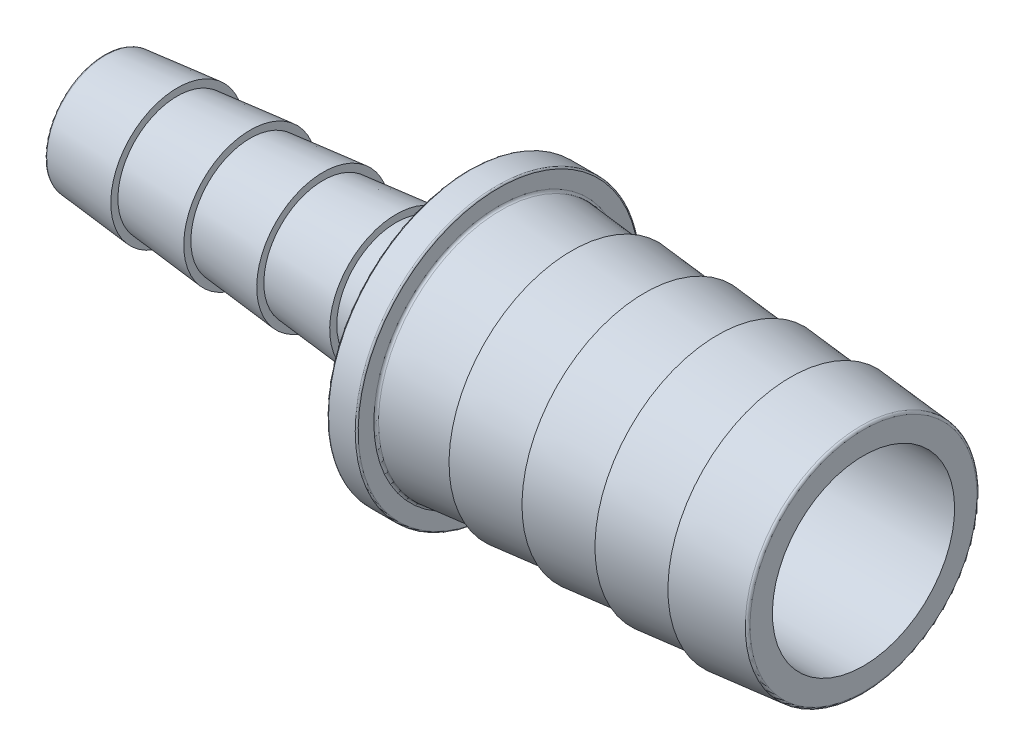
ISO-10303-21;
HEADER;
FILE_DESCRIPTION(('STEP AP214'),'2;1');
FILE_NAME('part.step','',(''),(''),'','','');
FILE_SCHEMA(('AUTOMOTIVE_DESIGN { 1 0 10303 214 1 1 1 1 }'));
ENDSEC;
DATA;
#1=APPLICATION_CONTEXT('core data for automotive mechanical design processes');
#2=APPLICATION_PROTOCOL_DEFINITION('international standard','automotive_design',2000,#1);
#3=PRODUCT_CONTEXT('',#1,'mechanical');
#4=PRODUCT('Part','Part','',(#3));
#5=PRODUCT_RELATED_PRODUCT_CATEGORY('part','',(#4));
#6=PRODUCT_DEFINITION_FORMATION('','',#4);
#7=PRODUCT_DEFINITION_CONTEXT('part definition',#1,'design');
#8=PRODUCT_DEFINITION('design','',#6,#7);
#9=PRODUCT_DEFINITION_SHAPE('','',#8);
#10=(LENGTH_UNIT() NAMED_UNIT(*) SI_UNIT(.MILLI.,.METRE.));
#11=(NAMED_UNIT(*) PLANE_ANGLE_UNIT() SI_UNIT($,.RADIAN.));
#12=(NAMED_UNIT(*) SI_UNIT($,.STERADIAN.) SOLID_ANGLE_UNIT());
#13=UNCERTAINTY_MEASURE_WITH_UNIT(LENGTH_MEASURE(1.E-05),#10,'distance_accuracy_value','');
#14=(GEOMETRIC_REPRESENTATION_CONTEXT(3) GLOBAL_UNCERTAINTY_ASSIGNED_CONTEXT((#13)) GLOBAL_UNIT_ASSIGNED_CONTEXT((#10,
#11,#12)) REPRESENTATION_CONTEXT('',''));
#15=CARTESIAN_POINT('',(0.,0.,0.));
#16=DIRECTION('',(0.,0.,1.));
#17=DIRECTION('',(1.,0.,0.));
#18=AXIS2_PLACEMENT_3D('',#15,#16,#17);
#19=CARTESIAN_POINT('',(-25.4,3.96875,0.));
#20=DIRECTION('',(1.,0.,0.));
#21=DIRECTION('',(0.,1.,0.));
#22=AXIS2_PLACEMENT_3D('',#19,#20,#21);
#23=PLANE('',#22);
#24=CARTESIAN_POINT('',(-25.4,0.,0.));
#25=DIRECTION('',(1.,0.,0.));
#26=DIRECTION('',(0.,1.,0.));
#27=AXIS2_PLACEMENT_3D('',#24,#25,#26);
#28=CIRCLE('',#27,3.83913486377598);
#29=CARTESIAN_POINT('',(-25.4,3.83913486377598,0.));
#30=VERTEX_POINT('',#29);
#31=EDGE_CURVE('E66',#30,#30,#28,.F.);
#32=ORIENTED_EDGE('',*,*,#31,.T.);
#33=EDGE_LOOP('',(#32));
#34=FACE_BOUND('',#33,.T.);
#35=CARTESIAN_POINT('',(-25.4,0.,0.));
#36=DIRECTION('',(-1.,0.,0.));
#37=DIRECTION('',(0.,-1.,0.));
#38=AXIS2_PLACEMENT_3D('',#35,#36,#37);
#39=CIRCLE('',#38,2.54);
#40=CARTESIAN_POINT('',(-25.4,-2.54,0.));
#41=VERTEX_POINT('',#40);
#42=EDGE_CURVE('E94',#41,#41,#39,.T.);
#43=ORIENTED_EDGE('',*,*,#42,.F.);
#44=EDGE_LOOP('',(#43));
#45=FACE_BOUND('',#44,.T.);
#46=ADVANCED_FACE('F38',(#34,#45),#23,.F.);
#47=CARTESIAN_POINT('',(-25.4,0.,0.));
#48=DIRECTION('',(-1.,0.,0.));
#49=DIRECTION('',(0.,-1.,0.));
#50=AXIS2_PLACEMENT_3D('',#47,#48,#49);
#51=CYLINDRICAL_SURFACE('',#50,2.54);
#52=CARTESIAN_POINT('',(-0.990600000000001,0.,0.));
#53=DIRECTION('',(-1.,0.,0.));
#54=DIRECTION('',(0.,-1.,0.));
#55=AXIS2_PLACEMENT_3D('',#52,#53,#54);
#56=CIRCLE('',#55,2.54);
#57=CARTESIAN_POINT('',(-0.990600000000001,-2.53999999999999,0.));
#58=VERTEX_POINT('',#57);
#59=EDGE_CURVE('E98',#58,#58,#56,.T.);
#60=ORIENTED_EDGE('',*,*,#59,.F.);
#61=EDGE_LOOP('',(#60));
#62=FACE_BOUND('',#61,.T.);
#63=ORIENTED_EDGE('',*,*,#42,.T.);
#64=EDGE_LOOP('',(#63));
#65=FACE_BOUND('',#64,.T.);
#66=ADVANCED_FACE('F218',(#62,#65),#51,.F.);
#67=CARTESIAN_POINT('',(-0.990600000000001,0.,0.));
#68=DIRECTION('',(1.,0.,0.));
#69=DIRECTION('',(0.,1.,0.));
#70=AXIS2_PLACEMENT_3D('',#67,#68,#69);
#71=CONICAL_SURFACE('',#70,2.54,1.06248570178407);
#72=CARTESIAN_POINT('',(0.990600000000005,0.,0.));
#73=DIRECTION('',(-1.,0.,0.));
#74=DIRECTION('',(0.,-1.,0.));
#75=AXIS2_PLACEMENT_3D('',#72,#73,#74);
#76=CIRCLE('',#75,6.09599999999999);
#77=CARTESIAN_POINT('',(0.990600000000006,-6.09599999999998,0.));
#78=VERTEX_POINT('',#77);
#79=EDGE_CURVE('E102',#78,#78,#76,.T.);
#80=ORIENTED_EDGE('',*,*,#79,.F.);
#81=EDGE_LOOP('',(#80));
#82=FACE_BOUND('',#81,.T.);
#83=ORIENTED_EDGE('',*,*,#59,.T.);
#84=EDGE_LOOP('',(#83));
#85=FACE_BOUND('',#84,.T.);
#86=ADVANCED_FACE('F224',(#82,#85),#71,.F.);
#87=CARTESIAN_POINT('',(-25.4,0.,0.));
#88=DIRECTION('',(-1.,0.,0.));
#89=DIRECTION('',(0.,-1.,0.));
#90=AXIS2_PLACEMENT_3D('',#87,#88,#89);
#91=CYLINDRICAL_SURFACE('',#90,6.09599999999999);
#92=CARTESIAN_POINT('',(25.4,0.,0.));
#93=DIRECTION('',(-1.,0.,0.));
#94=DIRECTION('',(0.,-1.,0.));
#95=AXIS2_PLACEMENT_3D('',#92,#93,#94);
#96=CIRCLE('',#95,6.09599999999999);
#97=CARTESIAN_POINT('',(25.4,-6.09599999999998,0.));
#98=VERTEX_POINT('',#97);
#99=EDGE_CURVE('E106',#98,#98,#96,.T.);
#100=ORIENTED_EDGE('',*,*,#99,.F.);
#101=EDGE_LOOP('',(#100));
#102=FACE_BOUND('',#101,.T.);
#103=ORIENTED_EDGE('',*,*,#79,.T.);
#104=EDGE_LOOP('',(#103));
#105=FACE_BOUND('',#104,.T.);
#106=ADVANCED_FACE('F293',(#102,#105),#91,.F.);
#107=CARTESIAN_POINT('',(25.4,7.747,0.));
#108=DIRECTION('',(-1.,0.,0.));
#109=DIRECTION('',(0.,-1.,0.));
#110=AXIS2_PLACEMENT_3D('',#107,#108,#109);
#111=PLANE('',#110);
#112=CARTESIAN_POINT('',(25.4,0.,0.));
#113=DIRECTION('',(-1.,0.,0.));
#114=DIRECTION('',(0.,-1.,0.));
#115=AXIS2_PLACEMENT_3D('',#112,#113,#114);
#116=CIRCLE('',#115,7.59663957144658);
#117=CARTESIAN_POINT('',(25.4,-7.59663957144657,0.));
#118=VERTEX_POINT('',#117);
#119=EDGE_CURVE('E10',#118,#118,#116,.F.);
#120=ORIENTED_EDGE('',*,*,#119,.T.);
#121=EDGE_LOOP('',(#120));
#122=FACE_BOUND('',#121,.T.);
#123=ORIENTED_EDGE('',*,*,#99,.T.);
#124=EDGE_LOOP('',(#123));
#125=FACE_BOUND('',#124,.T.);
#126=ADVANCED_FACE('F289',(#122,#125),#111,.F.);
#127=CARTESIAN_POINT('',(5.87248000000001,0.,0.));
#128=DIRECTION('',(-1.,0.,0.));
#129=DIRECTION('',(0.,-1.,0.));
#130=AXIS2_PLACEMENT_3D('',#127,#128,#129);
#131=CONICAL_SURFACE('',#130,7.74699999999999,0.0933800755950984);
#132=CARTESIAN_POINT('',(1.14030534545102,0.,0.));
#133=DIRECTION('',(-1.,0.,0.));
#134=DIRECTION('',(0.,-1.,0.));
#135=AXIS2_PLACEMENT_3D('',#132,#133,#134);
#136=CIRCLE('',#135,8.19017972831364);
#137=CARTESIAN_POINT('',(1.14030534545102,-8.19017972831363,0.));
#138=VERTEX_POINT('',#137);
#139=EDGE_CURVE('E51',#138,#138,#136,.F.);
#140=ORIENTED_EDGE('',*,*,#139,.T.);
#141=EDGE_LOOP('',(#140));
#142=FACE_BOUND('',#141,.T.);
#143=CARTESIAN_POINT('',(5.87247999999999,0.,0.));
#144=DIRECTION('',(-1.,0.,0.));
#145=DIRECTION('',(0.,-1.,0.));
#146=AXIS2_PLACEMENT_3D('',#143,#144,#145);
#147=CIRCLE('',#146,7.74699999999999);
#148=CARTESIAN_POINT('',(5.87248,-7.74699999999998,0.));
#149=VERTEX_POINT('',#148);
#150=EDGE_CURVE('E166',#149,#149,#147,.T.);
#151=ORIENTED_EDGE('',*,*,#150,.T.);
#152=EDGE_LOOP('',(#151));
#153=FACE_BOUND('',#152,.T.);
#154=ADVANCED_FACE('F261',(#142,#153),#131,.T.);
#155=CARTESIAN_POINT('',(0.990600000000004,9.4996,0.));
#156=DIRECTION('',(-1.,0.,0.));
#157=DIRECTION('',(0.,-1.,0.));
#158=AXIS2_PLACEMENT_3D('',#155,#156,#157);
#159=PLANE('',#158);
#160=CARTESIAN_POINT('',(0.990600000000006,0.,0.));
#161=DIRECTION('',(-1.,0.,0.));
#162=DIRECTION('',(0.,-1.,0.));
#163=AXIS2_PLACEMENT_3D('',#160,#161,#162);
#164=CIRCLE('',#163,8.35456042855341);
#165=CARTESIAN_POINT('',(0.990600000000008,-8.3545604285534,0.));
#166=VERTEX_POINT('',#165);
#167=EDGE_CURVE('E56',#166,#166,#164,.T.);
#168=ORIENTED_EDGE('',*,*,#167,.T.);
#169=EDGE_LOOP('',(#168));
#170=FACE_BOUND('',#169,.T.);
#171=CARTESIAN_POINT('',(0.990600000000006,0.,0.));
#172=DIRECTION('',(-1.,0.,0.));
#173=DIRECTION('',(0.,-1.,0.));
#174=AXIS2_PLACEMENT_3D('',#171,#172,#173);
#175=CIRCLE('',#174,9.40054);
#176=CARTESIAN_POINT('',(0.990600000000008,-9.40053999999999,0.));
#177=VERTEX_POINT('',#176);
#178=EDGE_CURVE('E82',#177,#177,#175,.F.);
#179=ORIENTED_EDGE('',*,*,#178,.T.);
#180=EDGE_LOOP('',(#179));
#181=FACE_BOUND('',#180,.T.);
#182=ADVANCED_FACE('F257',(#170,#181),#159,.F.);
#183=CARTESIAN_POINT('',(-25.4,0.,0.));
#184=DIRECTION('',(-1.,0.,0.));
#185=DIRECTION('',(0.,-1.,0.));
#186=AXIS2_PLACEMENT_3D('',#183,#184,#185);
#187=CYLINDRICAL_SURFACE('',#186,9.4996);
#188=CARTESIAN_POINT('',(0.891540000000007,0.,0.));
#189=DIRECTION('',(-1.,0.,0.));
#190=DIRECTION('',(0.,-1.,0.));
#191=AXIS2_PLACEMENT_3D('',#188,#189,#190);
#192=CIRCLE('',#191,9.4996);
#193=CARTESIAN_POINT('',(0.891540000000008,-9.49959999999999,0.));
#194=VERTEX_POINT('',#193);
#195=EDGE_CURVE('E86',#194,#194,#192,.T.);
#196=ORIENTED_EDGE('',*,*,#195,.T.);
#197=EDGE_LOOP('',(#196));
#198=FACE_BOUND('',#197,.T.);
#199=CARTESIAN_POINT('',(-0.891540000000007,0.,0.));
#200=DIRECTION('',(1.,0.,0.));
#201=DIRECTION('',(0.,1.,0.));
#202=AXIS2_PLACEMENT_3D('',#199,#200,#201);
#203=CIRCLE('',#202,9.4996);
#204=CARTESIAN_POINT('',(-0.891540000000008,9.4996,0.));
#205=VERTEX_POINT('',#204);
#206=EDGE_CURVE('E90',#205,#205,#203,.T.);
#207=ORIENTED_EDGE('',*,*,#206,.T.);
#208=EDGE_LOOP('',(#207));
#209=FACE_BOUND('',#208,.T.);
#210=ADVANCED_FACE('F260',(#198,#209),#187,.T.);
#211=CARTESIAN_POINT('',(-0.990600000000002,4.445,0.));
#212=DIRECTION('',(1.,0.,0.));
#213=DIRECTION('',(0.,1.,0.));
#214=AXIS2_PLACEMENT_3D('',#211,#212,#213);
#215=PLANE('',#214);
#216=CARTESIAN_POINT('',(-0.990600000000001,0.,0.));
#217=DIRECTION('',(1.,0.,0.));
#218=DIRECTION('',(0.,1.,0.));
#219=AXIS2_PLACEMENT_3D('',#216,#217,#218);
#220=CIRCLE('',#219,4.57461513622401);
#221=CARTESIAN_POINT('',(-0.990600000000002,4.57461513622402,0.));
#222=VERTEX_POINT('',#221);
#223=EDGE_CURVE('E70',#222,#222,#220,.T.);
#224=ORIENTED_EDGE('',*,*,#223,.T.);
#225=EDGE_LOOP('',(#224));
#226=FACE_BOUND('',#225,.T.);
#227=CARTESIAN_POINT('',(-0.990600000000001,0.,0.));
#228=DIRECTION('',(1.,0.,0.));
#229=DIRECTION('',(0.,1.,0.));
#230=AXIS2_PLACEMENT_3D('',#227,#228,#229);
#231=CIRCLE('',#230,9.40054);
#232=CARTESIAN_POINT('',(-0.990600000000002,9.40054,0.));
#233=VERTEX_POINT('',#232);
#234=EDGE_CURVE('E78',#233,#233,#231,.F.);
#235=ORIENTED_EDGE('',*,*,#234,.T.);
#236=EDGE_LOOP('',(#235));
#237=FACE_BOUND('',#236,.T.);
#238=ADVANCED_FACE('F269',(#226,#237),#215,.F.);
#239=CARTESIAN_POINT('',(-0.990600000000001,0.,0.));
#240=DIRECTION('',(1.,0.,0.));
#241=DIRECTION('',(0.,1.,0.));
#242=AXIS2_PLACEMENT_3D('',#239,#240,#241);
#243=CONICAL_SURFACE('',#242,4.44499999999999,0.0972469130544617);
#244=CARTESIAN_POINT('',(-1.11960273635716,0.,0.));
#245=DIRECTION('',(1.,0.,0.));
#246=DIRECTION('',(0.,1.,0.));
#247=AXIS2_PLACEMENT_3D('',#244,#245,#246);
#248=CIRCLE('',#247,4.43241518570917);
#249=CARTESIAN_POINT('',(-1.11960273635716,4.43241518570917,0.));
#250=VERTEX_POINT('',#249);
#251=EDGE_CURVE('E74',#250,#250,#248,.F.);
#252=ORIENTED_EDGE('',*,*,#251,.T.);
#253=EDGE_LOOP('',(#252));
#254=FACE_BOUND('',#253,.T.);
#255=CARTESIAN_POINT('',(-5.87248,0.,0.));
#256=DIRECTION('',(-1.,0.,0.));
#257=DIRECTION('',(0.,-1.,0.));
#258=AXIS2_PLACEMENT_3D('',#255,#256,#257);
#259=CIRCLE('',#258,3.96875);
#260=CARTESIAN_POINT('',(-5.87248,-3.96874999999999,0.));
#261=VERTEX_POINT('',#260);
#262=EDGE_CURVE('E110',#261,#261,#259,.T.);
#263=ORIENTED_EDGE('',*,*,#262,.F.);
#264=EDGE_LOOP('',(#263));
#265=FACE_BOUND('',#264,.T.);
#266=ADVANCED_FACE('F276',(#254,#265),#243,.T.);
#267=CARTESIAN_POINT('',(-20.51812,0.,0.));
#268=DIRECTION('',(1.,0.,0.));
#269=DIRECTION('',(0.,1.,0.));
#270=AXIS2_PLACEMENT_3D('',#267,#268,#269);
#271=CONICAL_SURFACE('',#270,4.445,0.0972469130544618);
#272=CARTESIAN_POINT('',(-25.2709972636428,0.,0.));
#273=DIRECTION('',(-1.,0.,0.));
#274=DIRECTION('',(0.,-1.,0.));
#275=AXIS2_PLACEMENT_3D('',#272,#273,#274);
#276=CIRCLE('',#275,3.98133481429083);
#277=CARTESIAN_POINT('',(-25.2709972636428,-3.98133481429083,0.));
#278=VERTEX_POINT('',#277);
#279=EDGE_CURVE('E62',#278,#278,#276,.F.);
#280=ORIENTED_EDGE('',*,*,#279,.T.);
#281=EDGE_LOOP('',(#280));
#282=FACE_BOUND('',#281,.T.);
#283=CARTESIAN_POINT('',(-20.51812,0.,0.));
#284=DIRECTION('',(-1.,0.,0.));
#285=DIRECTION('',(0.,-1.,0.));
#286=AXIS2_PLACEMENT_3D('',#283,#284,#285);
#287=CIRCLE('',#286,4.445);
#288=CARTESIAN_POINT('',(-20.51812,-4.445,0.));
#289=VERTEX_POINT('',#288);
#290=EDGE_CURVE('E114',#289,#289,#287,.T.);
#291=ORIENTED_EDGE('',*,*,#290,.T.);
#292=EDGE_LOOP('',(#291));
#293=FACE_BOUND('',#292,.T.);
#294=ADVANCED_FACE('F282',(#282,#293),#271,.T.);
#295=CARTESIAN_POINT('',(-20.51812,3.96875,0.));
#296=DIRECTION('',(-1.,0.,0.));
#297=DIRECTION('',(0.,-1.,0.));
#298=AXIS2_PLACEMENT_3D('',#295,#296,#297);
#299=PLANE('',#298);
#300=ORIENTED_EDGE('',*,*,#290,.F.);
#301=EDGE_LOOP('',(#300));
#302=FACE_BOUND('',#301,.T.);
#303=CARTESIAN_POINT('',(-20.51812,0.,0.));
#304=DIRECTION('',(-1.,0.,0.));
#305=DIRECTION('',(0.,-1.,0.));
#306=AXIS2_PLACEMENT_3D('',#303,#304,#305);
#307=CIRCLE('',#306,3.96875);
#308=CARTESIAN_POINT('',(-20.51812,-3.96875,0.));
#309=VERTEX_POINT('',#308);
#310=EDGE_CURVE('E122',#309,#309,#307,.T.);
#311=ORIENTED_EDGE('',*,*,#310,.T.);
#312=EDGE_LOOP('',(#311));
#313=FACE_BOUND('',#312,.T.);
#314=ADVANCED_FACE('F372',(#302,#313),#299,.F.);
#315=CARTESIAN_POINT('',(-15.63624,0.,0.));
#316=DIRECTION('',(1.,0.,0.));
#317=DIRECTION('',(0.,1.,0.));
#318=AXIS2_PLACEMENT_3D('',#315,#316,#317);
#319=CONICAL_SURFACE('',#318,4.445,0.0972469130544618);
#320=ORIENTED_EDGE('',*,*,#310,.F.);
#321=EDGE_LOOP('',(#320));
#322=FACE_BOUND('',#321,.T.);
#323=CARTESIAN_POINT('',(-15.63624,0.,0.));
#324=DIRECTION('',(-1.,0.,0.));
#325=DIRECTION('',(0.,-1.,0.));
#326=AXIS2_PLACEMENT_3D('',#323,#324,#325);
#327=CIRCLE('',#326,4.445);
#328=CARTESIAN_POINT('',(-15.63624,-4.445,0.));
#329=VERTEX_POINT('',#328);
#330=EDGE_CURVE('E118',#329,#329,#327,.T.);
#331=ORIENTED_EDGE('',*,*,#330,.T.);
#332=EDGE_LOOP('',(#331));
#333=FACE_BOUND('',#332,.T.);
#334=ADVANCED_FACE('F490',(#322,#333),#319,.T.);
#335=CARTESIAN_POINT('',(-15.63624,3.96875,0.));
#336=DIRECTION('',(-1.,0.,0.));
#337=DIRECTION('',(0.,-1.,0.));
#338=AXIS2_PLACEMENT_3D('',#335,#336,#337);
#339=PLANE('',#338);
#340=ORIENTED_EDGE('',*,*,#330,.F.);
#341=EDGE_LOOP('',(#340));
#342=FACE_BOUND('',#341,.T.);
#343=CARTESIAN_POINT('',(-15.63624,0.,0.));
#344=DIRECTION('',(-1.,0.,0.));
#345=DIRECTION('',(0.,-1.,0.));
#346=AXIS2_PLACEMENT_3D('',#343,#344,#345);
#347=CIRCLE('',#346,3.96875);
#348=CARTESIAN_POINT('',(-15.63624,-3.96875,0.));
#349=VERTEX_POINT('',#348);
#350=EDGE_CURVE('E130',#349,#349,#347,.T.);
#351=ORIENTED_EDGE('',*,*,#350,.T.);
#352=EDGE_LOOP('',(#351));
#353=FACE_BOUND('',#352,.T.);
#354=ADVANCED_FACE('F480',(#342,#353),#339,.F.);
#355=CARTESIAN_POINT('',(-10.75436,0.,0.));
#356=DIRECTION('',(1.,0.,0.));
#357=DIRECTION('',(0.,1.,0.));
#358=AXIS2_PLACEMENT_3D('',#355,#356,#357);
#359=CONICAL_SURFACE('',#358,4.445,0.0972469130544618);
#360=ORIENTED_EDGE('',*,*,#350,.F.);
#361=EDGE_LOOP('',(#360));
#362=FACE_BOUND('',#361,.T.);
#363=CARTESIAN_POINT('',(-10.75436,0.,0.));
#364=DIRECTION('',(-1.,0.,0.));
#365=DIRECTION('',(0.,-1.,0.));
#366=AXIS2_PLACEMENT_3D('',#363,#364,#365);
#367=CIRCLE('',#366,4.445);
#368=CARTESIAN_POINT('',(-10.75436,-4.445,0.));
#369=VERTEX_POINT('',#368);
#370=EDGE_CURVE('E126',#369,#369,#367,.T.);
#371=ORIENTED_EDGE('',*,*,#370,.T.);
#372=EDGE_LOOP('',(#371));
#373=FACE_BOUND('',#372,.T.);
#374=ADVANCED_FACE('F470',(#362,#373),#359,.T.);
#375=CARTESIAN_POINT('',(-10.75436,3.96875,0.));
#376=DIRECTION('',(-1.,0.,0.));
#377=DIRECTION('',(0.,-1.,0.));
#378=AXIS2_PLACEMENT_3D('',#375,#376,#377);
#379=PLANE('',#378);
#380=ORIENTED_EDGE('',*,*,#370,.F.);
#381=EDGE_LOOP('',(#380));
#382=FACE_BOUND('',#381,.T.);
#383=CARTESIAN_POINT('',(-10.75436,0.,0.));
#384=DIRECTION('',(-1.,0.,0.));
#385=DIRECTION('',(0.,-1.,0.));
#386=AXIS2_PLACEMENT_3D('',#383,#384,#385);
#387=CIRCLE('',#386,3.96875);
#388=CARTESIAN_POINT('',(-10.75436,-3.96875,0.));
#389=VERTEX_POINT('',#388);
#390=EDGE_CURVE('E138',#389,#389,#387,.T.);
#391=ORIENTED_EDGE('',*,*,#390,.T.);
#392=EDGE_LOOP('',(#391));
#393=FACE_BOUND('',#392,.T.);
#394=ADVANCED_FACE('F460',(#382,#393),#379,.F.);
#395=CARTESIAN_POINT('',(-5.87248,0.,0.));
#396=DIRECTION('',(1.,0.,0.));
#397=DIRECTION('',(0.,1.,0.));
#398=AXIS2_PLACEMENT_3D('',#395,#396,#397);
#399=CONICAL_SURFACE('',#398,4.445,0.0972469130544618);
#400=ORIENTED_EDGE('',*,*,#390,.F.);
#401=EDGE_LOOP('',(#400));
#402=FACE_BOUND('',#401,.T.);
#403=CARTESIAN_POINT('',(-5.87248,0.,0.));
#404=DIRECTION('',(-1.,0.,0.));
#405=DIRECTION('',(0.,-1.,0.));
#406=AXIS2_PLACEMENT_3D('',#403,#404,#405);
#407=CIRCLE('',#406,4.445);
#408=CARTESIAN_POINT('',(-5.87248,-4.445,0.));
#409=VERTEX_POINT('',#408);
#410=EDGE_CURVE('E134',#409,#409,#407,.T.);
#411=ORIENTED_EDGE('',*,*,#410,.T.);
#412=EDGE_LOOP('',(#411));
#413=FACE_BOUND('',#412,.T.);
#414=ADVANCED_FACE('F214',(#402,#413),#399,.T.);
#415=CARTESIAN_POINT('',(-5.87248,3.96875,0.));
#416=DIRECTION('',(-1.,0.,0.));
#417=DIRECTION('',(0.,-1.,0.));
#418=AXIS2_PLACEMENT_3D('',#415,#416,#417);
#419=PLANE('',#418);
#420=ORIENTED_EDGE('',*,*,#410,.F.);
#421=EDGE_LOOP('',(#420));
#422=FACE_BOUND('',#421,.T.);
#423=ORIENTED_EDGE('',*,*,#262,.T.);
#424=EDGE_LOOP('',(#423));
#425=FACE_BOUND('',#424,.T.);
#426=ADVANCED_FACE('F209',(#422,#425),#419,.F.);
#427=CARTESIAN_POINT('',(25.4,0.,0.));
#428=DIRECTION('',(-1.,0.,0.));
#429=DIRECTION('',(0.,-1.,0.));
#430=AXIS2_PLACEMENT_3D('',#427,#428,#429);
#431=CONICAL_SURFACE('',#430,7.74699999999999,0.0933800755950978);
#432=CARTESIAN_POINT('',(25.250294654549,0.,0.));
#433=DIRECTION('',(1.,0.,0.));
#434=DIRECTION('',(0.,1.,0.));
#435=AXIS2_PLACEMENT_3D('',#432,#433,#434);
#436=CIRCLE('',#435,7.76102027168635);
#437=CARTESIAN_POINT('',(25.250294654549,7.76102027168636,0.));
#438=VERTEX_POINT('',#437);
#439=EDGE_CURVE('E46',#438,#438,#436,.F.);
#440=ORIENTED_EDGE('',*,*,#439,.T.);
#441=EDGE_LOOP('',(#440));
#442=FACE_BOUND('',#441,.T.);
#443=CARTESIAN_POINT('',(20.51812,0.,0.));
#444=DIRECTION('',(-1.,0.,0.));
#445=DIRECTION('',(0.,-1.,0.));
#446=AXIS2_PLACEMENT_3D('',#443,#444,#445);
#447=CIRCLE('',#446,8.20419999999999);
#448=CARTESIAN_POINT('',(20.51812,-8.20419999999998,0.));
#449=VERTEX_POINT('',#448);
#450=EDGE_CURVE('E142',#449,#449,#447,.T.);
#451=ORIENTED_EDGE('',*,*,#450,.F.);
#452=EDGE_LOOP('',(#451));
#453=FACE_BOUND('',#452,.T.);
#454=ADVANCED_FACE('F204',(#442,#453),#431,.T.);
#455=CARTESIAN_POINT('',(20.51812,7.747,0.));
#456=DIRECTION('',(1.,0.,0.));
#457=DIRECTION('',(0.,1.,0.));
#458=AXIS2_PLACEMENT_3D('',#455,#456,#457);
#459=PLANE('',#458);
#460=CARTESIAN_POINT('',(20.51812,0.,0.));
#461=DIRECTION('',(-1.,0.,0.));
#462=DIRECTION('',(0.,-1.,0.));
#463=AXIS2_PLACEMENT_3D('',#460,#461,#462);
#464=CIRCLE('',#463,7.74699999999999);
#465=CARTESIAN_POINT('',(20.51812,-7.74699999999998,0.));
#466=VERTEX_POINT('',#465);
#467=EDGE_CURVE('E150',#466,#466,#464,.T.);
#468=ORIENTED_EDGE('',*,*,#467,.F.);
#469=EDGE_LOOP('',(#468));
#470=FACE_BOUND('',#469,.T.);
#471=ORIENTED_EDGE('',*,*,#450,.T.);
#472=EDGE_LOOP('',(#471));
#473=FACE_BOUND('',#472,.T.);
#474=ADVANCED_FACE('F198',(#470,#473),#459,.F.);
#475=CARTESIAN_POINT('',(20.51812,0.,0.));
#476=DIRECTION('',(-1.,0.,0.));
#477=DIRECTION('',(0.,-1.,0.));
#478=AXIS2_PLACEMENT_3D('',#475,#476,#477);
#479=CONICAL_SURFACE('',#478,7.74699999999999,0.0933800755950978);
#480=CARTESIAN_POINT('',(15.63624,0.,0.));
#481=DIRECTION('',(-1.,0.,0.));
#482=DIRECTION('',(0.,-1.,0.));
#483=AXIS2_PLACEMENT_3D('',#480,#481,#482);
#484=CIRCLE('',#483,8.20419999999999);
#485=CARTESIAN_POINT('',(15.63624,-8.20419999999998,0.));
#486=VERTEX_POINT('',#485);
#487=EDGE_CURVE('E146',#486,#486,#484,.T.);
#488=ORIENTED_EDGE('',*,*,#487,.F.);
#489=EDGE_LOOP('',(#488));
#490=FACE_BOUND('',#489,.T.);
#491=ORIENTED_EDGE('',*,*,#467,.T.);
#492=EDGE_LOOP('',(#491));
#493=FACE_BOUND('',#492,.T.);
#494=ADVANCED_FACE('F192',(#490,#493),#479,.T.);
#495=CARTESIAN_POINT('',(15.63624,7.747,0.));
#496=DIRECTION('',(1.,0.,0.));
#497=DIRECTION('',(0.,1.,0.));
#498=AXIS2_PLACEMENT_3D('',#495,#496,#497);
#499=PLANE('',#498);
#500=CARTESIAN_POINT('',(15.63624,0.,0.));
#501=DIRECTION('',(-1.,0.,0.));
#502=DIRECTION('',(0.,-1.,0.));
#503=AXIS2_PLACEMENT_3D('',#500,#501,#502);
#504=CIRCLE('',#503,7.74699999999999);
#505=CARTESIAN_POINT('',(15.63624,-7.74699999999998,0.));
#506=VERTEX_POINT('',#505);
#507=EDGE_CURVE('E158',#506,#506,#504,.T.);
#508=ORIENTED_EDGE('',*,*,#507,.F.);
#509=EDGE_LOOP('',(#508));
#510=FACE_BOUND('',#509,.T.);
#511=ORIENTED_EDGE('',*,*,#487,.T.);
#512=EDGE_LOOP('',(#511));
#513=FACE_BOUND('',#512,.T.);
#514=ADVANCED_FACE('F186',(#510,#513),#499,.F.);
#515=CARTESIAN_POINT('',(15.63624,0.,0.));
#516=DIRECTION('',(-1.,0.,0.));
#517=DIRECTION('',(0.,-1.,0.));
#518=AXIS2_PLACEMENT_3D('',#515,#516,#517);
#519=CONICAL_SURFACE('',#518,7.74699999999999,0.0933800755950978);
#520=CARTESIAN_POINT('',(10.75436,0.,0.));
#521=DIRECTION('',(-1.,0.,0.));
#522=DIRECTION('',(0.,-1.,0.));
#523=AXIS2_PLACEMENT_3D('',#520,#521,#522);
#524=CIRCLE('',#523,8.20419999999999);
#525=CARTESIAN_POINT('',(10.75436,-8.20419999999998,0.));
#526=VERTEX_POINT('',#525);
#527=EDGE_CURVE('E154',#526,#526,#524,.T.);
#528=ORIENTED_EDGE('',*,*,#527,.F.);
#529=EDGE_LOOP('',(#528));
#530=FACE_BOUND('',#529,.T.);
#531=ORIENTED_EDGE('',*,*,#507,.T.);
#532=EDGE_LOOP('',(#531));
#533=FACE_BOUND('',#532,.T.);
#534=ADVANCED_FACE('F180',(#530,#533),#519,.T.);
#535=CARTESIAN_POINT('',(10.75436,7.747,0.));
#536=DIRECTION('',(1.,0.,0.));
#537=DIRECTION('',(0.,1.,0.));
#538=AXIS2_PLACEMENT_3D('',#535,#536,#537);
#539=PLANE('',#538);
#540=CARTESIAN_POINT('',(10.75436,0.,0.));
#541=DIRECTION('',(-1.,0.,0.));
#542=DIRECTION('',(0.,-1.,0.));
#543=AXIS2_PLACEMENT_3D('',#540,#541,#542);
#544=CIRCLE('',#543,7.74699999999999);
#545=CARTESIAN_POINT('',(10.75436,-7.74699999999998,0.));
#546=VERTEX_POINT('',#545);
#547=EDGE_CURVE('E170',#546,#546,#544,.T.);
#548=ORIENTED_EDGE('',*,*,#547,.F.);
#549=EDGE_LOOP('',(#548));
#550=FACE_BOUND('',#549,.T.);
#551=ORIENTED_EDGE('',*,*,#527,.T.);
#552=EDGE_LOOP('',(#551));
#553=FACE_BOUND('',#552,.T.);
#554=ADVANCED_FACE('F177',(#550,#553),#539,.F.);
#555=CARTESIAN_POINT('',(10.75436,0.,0.));
#556=DIRECTION('',(-1.,0.,0.));
#557=DIRECTION('',(0.,-1.,0.));
#558=AXIS2_PLACEMENT_3D('',#555,#556,#557);
#559=CONICAL_SURFACE('',#558,7.74699999999999,0.0933800755950978);
#560=CARTESIAN_POINT('',(5.87247999999999,0.,0.));
#561=DIRECTION('',(-1.,0.,0.));
#562=DIRECTION('',(0.,-1.,0.));
#563=AXIS2_PLACEMENT_3D('',#560,#561,#562);
#564=CIRCLE('',#563,8.20419999999999);
#565=CARTESIAN_POINT('',(5.87248,-8.20419999999998,0.));
#566=VERTEX_POINT('',#565);
#567=EDGE_CURVE('E162',#566,#566,#564,.T.);
#568=ORIENTED_EDGE('',*,*,#567,.F.);
#569=EDGE_LOOP('',(#568));
#570=FACE_BOUND('',#569,.T.);
#571=ORIENTED_EDGE('',*,*,#547,.T.);
#572=EDGE_LOOP('',(#571));
#573=FACE_BOUND('',#572,.T.);
#574=ADVANCED_FACE('F175',(#570,#573),#559,.T.);
#575=CARTESIAN_POINT('',(5.87248,7.747,0.));
#576=DIRECTION('',(1.,0.,0.));
#577=DIRECTION('',(0.,1.,0.));
#578=AXIS2_PLACEMENT_3D('',#575,#576,#577);
#579=PLANE('',#578);
#580=ORIENTED_EDGE('',*,*,#150,.F.);
#581=EDGE_LOOP('',(#580));
#582=FACE_BOUND('',#581,.T.);
#583=ORIENTED_EDGE('',*,*,#567,.T.);
#584=EDGE_LOOP('',(#583));
#585=FACE_BOUND('',#584,.T.);
#586=ADVANCED_FACE('F234',(#582,#585),#579,.F.);
#587=CARTESIAN_POINT('',(0.891540000000007,0.,0.));
#588=DIRECTION('',(-1.,0.,0.));
#589=DIRECTION('',(0.,-1.,0.));
#590=AXIS2_PLACEMENT_3D('',#587,#588,#589);
#591=TOROIDAL_SURFACE('',#590,9.40054,0.09906);
#592=ORIENTED_EDGE('',*,*,#178,.F.);
#593=EDGE_LOOP('',(#592));
#594=FACE_BOUND('',#593,.T.);
#595=ORIENTED_EDGE('',*,*,#195,.F.);
#596=EDGE_LOOP('',(#595));
#597=FACE_BOUND('',#596,.T.);
#598=ADVANCED_FACE('F230',(#594,#597),#591,.T.);
#599=CARTESIAN_POINT('',(-0.891540000000003,0.,0.));
#600=DIRECTION('',(1.,0.,0.));
#601=DIRECTION('',(0.,1.,0.));
#602=AXIS2_PLACEMENT_3D('',#599,#600,#601);
#603=TOROIDAL_SURFACE('',#602,9.40054,0.09906);
#604=ORIENTED_EDGE('',*,*,#206,.F.);
#605=EDGE_LOOP('',(#604));
#606=FACE_BOUND('',#605,.T.);
#607=ORIENTED_EDGE('',*,*,#234,.F.);
#608=EDGE_LOOP('',(#607));
#609=FACE_BOUND('',#608,.T.);
#610=ADVANCED_FACE('F233',(#606,#609),#603,.T.);
#611=CARTESIAN_POINT('',(-1.133475,0.,0.));
#612=DIRECTION('',(1.,0.,0.));
#613=DIRECTION('',(0.,1.,0.));
#614=AXIS2_PLACEMENT_3D('',#611,#612,#613);
#615=TOROIDAL_SURFACE('',#614,4.57461513622401,0.142875);
#616=ORIENTED_EDGE('',*,*,#223,.F.);
#617=EDGE_LOOP('',(#616));
#618=FACE_BOUND('',#617,.T.);
#619=ORIENTED_EDGE('',*,*,#251,.F.);
#620=EDGE_LOOP('',(#619));
#621=FACE_BOUND('',#620,.T.);
#622=ADVANCED_FACE('F238',(#618,#621),#615,.F.);
#623=CARTESIAN_POINT('',(-25.257125,0.,0.));
#624=DIRECTION('',(1.,0.,0.));
#625=DIRECTION('',(0.,1.,0.));
#626=AXIS2_PLACEMENT_3D('',#623,#624,#625);
#627=TOROIDAL_SURFACE('',#626,3.83913486377598,0.142875);
#628=ORIENTED_EDGE('',*,*,#279,.F.);
#629=EDGE_LOOP('',(#628));
#630=FACE_BOUND('',#629,.T.);
#631=ORIENTED_EDGE('',*,*,#31,.F.);
#632=EDGE_LOOP('',(#631));
#633=FACE_BOUND('',#632,.T.);
#634=ADVANCED_FACE('F242',(#630,#633),#627,.T.);
#635=CARTESIAN_POINT('',(1.15570000000001,0.,0.));
#636=DIRECTION('',(-1.,0.,0.));
#637=DIRECTION('',(0.,-1.,0.));
#638=AXIS2_PLACEMENT_3D('',#635,#636,#637);
#639=TOROIDAL_SURFACE('',#638,8.35456042855341,0.1651);
#640=ORIENTED_EDGE('',*,*,#139,.F.);
#641=EDGE_LOOP('',(#640));
#642=FACE_BOUND('',#641,.T.);
#643=ORIENTED_EDGE('',*,*,#167,.F.);
#644=EDGE_LOOP('',(#643));
#645=FACE_BOUND('',#644,.T.);
#646=ADVANCED_FACE('F245',(#642,#645),#639,.F.);
#647=CARTESIAN_POINT('',(25.2349,0.,0.));
#648=DIRECTION('',(-1.,0.,0.));
#649=DIRECTION('',(0.,-1.,0.));
#650=AXIS2_PLACEMENT_3D('',#647,#648,#649);
#651=TOROIDAL_SURFACE('',#650,7.59663957144658,0.1651);
#652=ORIENTED_EDGE('',*,*,#119,.F.);
#653=EDGE_LOOP('',(#652));
#654=FACE_BOUND('',#653,.T.);
#655=ORIENTED_EDGE('',*,*,#439,.F.);
#656=EDGE_LOOP('',(#655));
#657=FACE_BOUND('',#656,.T.);
#658=ADVANCED_FACE('F40',(#654,#657),#651,.T.);
#659=CLOSED_SHELL('',(#46,#66,#86,#106,#126,#154,#182,#210,#238,#266,#294,#314,#334,#354,#374,
#394,#414,#426,#454,#474,#494,#514,#534,#554,#574,#586,#598,#610,#622,#634,#646,#658));
#660=MANIFOLD_SOLID_BREP('B2',#659);
#661=ADVANCED_BREP_SHAPE_REPRESENTATION('',(#18,#660),#14);
#662=SHAPE_DEFINITION_REPRESENTATION(#9,#661);
ENDSEC;
END-ISO-10303-21;
